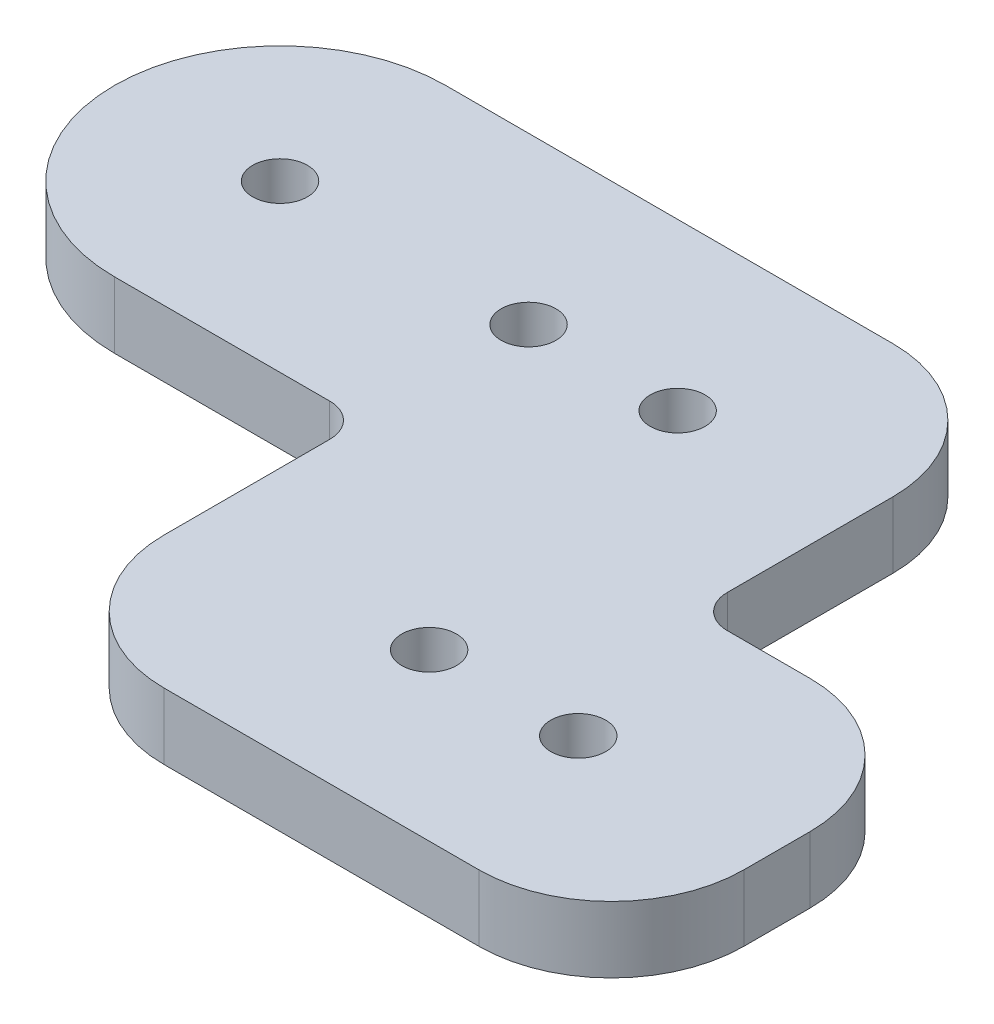
ISO-10303-21;
HEADER;
FILE_DESCRIPTION(('STEP AP214'),'2;1');
FILE_NAME('part.step','',(''),(''),'','','');
FILE_SCHEMA(('AUTOMOTIVE_DESIGN { 1 0 10303 214 1 1 1 1 }'));
ENDSEC;
DATA;
#1=APPLICATION_CONTEXT('core data for automotive mechanical design processes');
#2=APPLICATION_PROTOCOL_DEFINITION('international standard','automotive_design',2000,#1);
#3=PRODUCT_CONTEXT('',#1,'mechanical');
#4=PRODUCT('Part','Part','',(#3));
#5=PRODUCT_RELATED_PRODUCT_CATEGORY('part','',(#4));
#6=PRODUCT_DEFINITION_FORMATION('','',#4);
#7=PRODUCT_DEFINITION_CONTEXT('part definition',#1,'design');
#8=PRODUCT_DEFINITION('design','',#6,#7);
#9=PRODUCT_DEFINITION_SHAPE('','',#8);
#10=(LENGTH_UNIT() NAMED_UNIT(*) SI_UNIT(.MILLI.,.METRE.));
#11=(NAMED_UNIT(*) PLANE_ANGLE_UNIT() SI_UNIT($,.RADIAN.));
#12=(NAMED_UNIT(*) SI_UNIT($,.STERADIAN.) SOLID_ANGLE_UNIT());
#13=UNCERTAINTY_MEASURE_WITH_UNIT(LENGTH_MEASURE(1.E-05),#10,'distance_accuracy_value','');
#14=(GEOMETRIC_REPRESENTATION_CONTEXT(3) GLOBAL_UNCERTAINTY_ASSIGNED_CONTEXT((#13)) GLOBAL_UNIT_ASSIGNED_CONTEXT((#10,
#11,#12)) REPRESENTATION_CONTEXT('',''));
#15=CARTESIAN_POINT('',(0.,0.,0.));
#16=DIRECTION('',(0.,0.,1.));
#17=DIRECTION('',(1.,0.,0.));
#18=AXIS2_PLACEMENT_3D('',#15,#16,#17);
#19=CARTESIAN_POINT('',(0.,5.08,-12.7));
#20=DIRECTION('',(0.,0.,-1.));
#21=DIRECTION('',(-1.,0.,0.));
#22=AXIS2_PLACEMENT_3D('',#19,#20,#21);
#23=PLANE('',#22);
#24=DIRECTION('',(1.,0.,0.));
#25=VECTOR('',#24,1.);
#26=CARTESIAN_POINT('',(0.,5.08,-12.7));
#27=LINE('',#26,#25);
#28=CARTESIAN_POINT('',(0.,5.08,-12.7));
#29=VERTEX_POINT('',#28);
#30=CARTESIAN_POINT('',(34.29,5.08,-12.7));
#31=VERTEX_POINT('',#30);
#32=EDGE_CURVE('E143',#29,#31,#27,.T.);
#33=ORIENTED_EDGE('',*,*,#32,.T.);
#34=DIRECTION('',(0.,-1.,0.));
#35=VECTOR('',#34,1.);
#36=CARTESIAN_POINT('',(34.29,0.,-12.7));
#37=LINE('',#36,#35);
#38=CARTESIAN_POINT('',(34.29,0.,-12.7));
#39=VERTEX_POINT('',#38);
#40=EDGE_CURVE('E259',#31,#39,#37,.T.);
#41=ORIENTED_EDGE('',*,*,#40,.T.);
#42=DIRECTION('',(1.,0.,0.));
#43=VECTOR('',#42,1.);
#44=CARTESIAN_POINT('',(0.,0.,-12.7));
#45=LINE('',#44,#43);
#46=CARTESIAN_POINT('',(0.,0.,-12.7));
#47=VERTEX_POINT('',#46);
#48=EDGE_CURVE('E146',#47,#39,#45,.T.);
#49=ORIENTED_EDGE('',*,*,#48,.F.);
#50=DIRECTION('',(0.,-1.,0.));
#51=VECTOR('',#50,1.);
#52=CARTESIAN_POINT('',(0.,5.08,-12.7));
#53=LINE('',#52,#51);
#54=EDGE_CURVE('E139',#29,#47,#53,.T.);
#55=ORIENTED_EDGE('',*,*,#54,.F.);
#56=EDGE_LOOP('',(#33,#41,#49,#55));
#57=FACE_BOUND('',#56,.T.);
#58=ADVANCED_FACE('F35',(#57),#23,.T.);
#59=CARTESIAN_POINT('',(0.,5.08,0.));
#60=DIRECTION('',(0.,-1.,0.));
#61=DIRECTION('',(0.,0.,-1.));
#62=AXIS2_PLACEMENT_3D('',#59,#60,#61);
#63=CYLINDRICAL_SURFACE('',#62,12.7);
#64=CARTESIAN_POINT('',(0.,0.,0.));
#65=DIRECTION('',(0.,1.,0.));
#66=DIRECTION('',(0.,0.,1.));
#67=AXIS2_PLACEMENT_3D('',#64,#65,#66);
#68=CIRCLE('',#67,12.7);
#69=CARTESIAN_POINT('',(0.,0.,12.7));
#70=VERTEX_POINT('',#69);
#71=EDGE_CURVE('E200',#47,#70,#68,.T.);
#72=ORIENTED_EDGE('',*,*,#71,.T.);
#73=DIRECTION('',(0.,-1.,0.));
#74=VECTOR('',#73,1.);
#75=CARTESIAN_POINT('',(0.,5.08,12.7));
#76=LINE('',#75,#74);
#77=CARTESIAN_POINT('',(0.,5.08,12.7));
#78=VERTEX_POINT('',#77);
#79=EDGE_CURVE('E151',#78,#70,#76,.T.);
#80=ORIENTED_EDGE('',*,*,#79,.F.);
#81=CARTESIAN_POINT('',(0.,5.08,0.));
#82=DIRECTION('',(0.,1.,0.));
#83=DIRECTION('',(0.,0.,1.));
#84=AXIS2_PLACEMENT_3D('',#81,#82,#83);
#85=CIRCLE('',#84,12.7);
#86=EDGE_CURVE('E155',#29,#78,#85,.T.);
#87=ORIENTED_EDGE('',*,*,#86,.F.);
#88=ORIENTED_EDGE('',*,*,#54,.T.);
#89=EDGE_LOOP('',(#72,#80,#87,#88));
#90=FACE_BOUND('',#89,.T.);
#91=ADVANCED_FACE('F156',(#90),#63,.T.);
#92=CARTESIAN_POINT('',(0.,5.08,12.7));
#93=DIRECTION('',(0.,0.,-1.));
#94=DIRECTION('',(-1.,0.,0.));
#95=AXIS2_PLACEMENT_3D('',#92,#93,#94);
#96=PLANE('',#95);
#97=DIRECTION('',(1.,0.,0.));
#98=VECTOR('',#97,1.);
#99=CARTESIAN_POINT('',(0.,0.,12.7));
#100=LINE('',#99,#98);
#101=CARTESIAN_POINT('',(16.51,0.,12.7));
#102=VERTEX_POINT('',#101);
#103=EDGE_CURVE('E202',#70,#102,#100,.T.);
#104=ORIENTED_EDGE('',*,*,#103,.T.);
#105=DIRECTION('',(0.,-1.,0.));
#106=VECTOR('',#105,1.);
#107=CARTESIAN_POINT('',(16.51,5.08,12.7));
#108=LINE('',#107,#106);
#109=CARTESIAN_POINT('',(16.51,5.08,12.7));
#110=VERTEX_POINT('',#109);
#111=EDGE_CURVE('E227',#102,#110,#108,.F.);
#112=ORIENTED_EDGE('',*,*,#111,.T.);
#113=DIRECTION('',(1.,0.,0.));
#114=VECTOR('',#113,1.);
#115=CARTESIAN_POINT('',(0.,5.08,12.7));
#116=LINE('',#115,#114);
#117=EDGE_CURVE('E159',#78,#110,#116,.T.);
#118=ORIENTED_EDGE('',*,*,#117,.F.);
#119=ORIENTED_EDGE('',*,*,#79,.T.);
#120=EDGE_LOOP('',(#104,#112,#118,#119));
#121=FACE_BOUND('',#120,.T.);
#122=ADVANCED_FACE('F306',(#121),#96,.F.);
#123=CARTESIAN_POINT('',(19.05,5.08,0.));
#124=DIRECTION('',(-1.,0.,0.));
#125=DIRECTION('',(0.,0.,1.));
#126=AXIS2_PLACEMENT_3D('',#123,#124,#125);
#127=PLANE('',#126);
#128=DIRECTION('',(0.,0.,-1.));
#129=VECTOR('',#128,1.);
#130=CARTESIAN_POINT('',(19.05,0.,0.));
#131=LINE('',#130,#129);
#132=CARTESIAN_POINT('',(19.05,0.,27.94));
#133=VERTEX_POINT('',#132);
#134=CARTESIAN_POINT('',(19.05,0.,15.24));
#135=VERTEX_POINT('',#134);
#136=EDGE_CURVE('E205',#133,#135,#131,.T.);
#137=ORIENTED_EDGE('',*,*,#136,.F.);
#138=DIRECTION('',(0.,-1.,0.));
#139=VECTOR('',#138,1.);
#140=CARTESIAN_POINT('',(19.05,5.08,27.94));
#141=LINE('',#140,#139);
#142=CARTESIAN_POINT('',(19.05,5.08,27.94));
#143=VERTEX_POINT('',#142);
#144=EDGE_CURVE('E251',#133,#143,#141,.F.);
#145=ORIENTED_EDGE('',*,*,#144,.T.);
#146=DIRECTION('',(0.,0.,-1.));
#147=VECTOR('',#146,1.);
#148=CARTESIAN_POINT('',(19.05,5.08,0.));
#149=LINE('',#148,#147);
#150=CARTESIAN_POINT('',(19.05,5.08,15.24));
#151=VERTEX_POINT('',#150);
#152=EDGE_CURVE('E173',#143,#151,#149,.T.);
#153=ORIENTED_EDGE('',*,*,#152,.T.);
#154=DIRECTION('',(0.,-1.,0.));
#155=VECTOR('',#154,1.);
#156=CARTESIAN_POINT('',(19.05,5.08,15.24));
#157=LINE('',#156,#155);
#158=EDGE_CURVE('E224',#151,#135,#157,.T.);
#159=ORIENTED_EDGE('',*,*,#158,.T.);
#160=EDGE_LOOP('',(#137,#145,#153,#159));
#161=FACE_BOUND('',#160,.T.);
#162=ADVANCED_FACE('F344',(#161),#127,.T.);
#163=CARTESIAN_POINT('',(0.,5.08,38.1));
#164=DIRECTION('',(0.,0.,-1.));
#165=DIRECTION('',(-1.,0.,0.));
#166=AXIS2_PLACEMENT_3D('',#163,#164,#165);
#167=PLANE('',#166);
#168=DIRECTION('',(1.,0.,0.));
#169=VECTOR('',#168,1.);
#170=CARTESIAN_POINT('',(0.,5.08,38.1));
#171=LINE('',#170,#169);
#172=CARTESIAN_POINT('',(29.21,5.08,38.1));
#173=VERTEX_POINT('',#172);
#174=CARTESIAN_POINT('',(53.34,5.08,38.1));
#175=VERTEX_POINT('',#174);
#176=EDGE_CURVE('E175',#173,#175,#171,.T.);
#177=ORIENTED_EDGE('',*,*,#176,.F.);
#178=DIRECTION('',(0.,-1.,0.));
#179=VECTOR('',#178,1.);
#180=CARTESIAN_POINT('',(29.21,0.,38.1));
#181=LINE('',#180,#179);
#182=CARTESIAN_POINT('',(29.21,0.,38.1));
#183=VERTEX_POINT('',#182);
#184=EDGE_CURVE('E240',#173,#183,#181,.T.);
#185=ORIENTED_EDGE('',*,*,#184,.T.);
#186=DIRECTION('',(1.,0.,0.));
#187=VECTOR('',#186,1.);
#188=CARTESIAN_POINT('',(0.,0.,38.1));
#189=LINE('',#188,#187);
#190=CARTESIAN_POINT('',(53.34,0.,38.1));
#191=VERTEX_POINT('',#190);
#192=EDGE_CURVE('E207',#183,#191,#189,.T.);
#193=ORIENTED_EDGE('',*,*,#192,.T.);
#194=DIRECTION('',(0.,-1.,0.));
#195=VECTOR('',#194,1.);
#196=CARTESIAN_POINT('',(53.34,5.08,38.1));
#197=LINE('',#196,#195);
#198=EDGE_CURVE('E238',#191,#175,#197,.F.);
#199=ORIENTED_EDGE('',*,*,#198,.T.);
#200=EDGE_LOOP('',(#177,#185,#193,#199));
#201=FACE_BOUND('',#200,.T.);
#202=ADVANCED_FACE('F349',(#201),#167,.F.);
#203=CARTESIAN_POINT('',(63.5,5.08,0.));
#204=DIRECTION('',(-1.,0.,0.));
#205=DIRECTION('',(0.,0.,1.));
#206=AXIS2_PLACEMENT_3D('',#203,#204,#205);
#207=PLANE('',#206);
#208=DIRECTION('',(0.,0.,-1.));
#209=VECTOR('',#208,1.);
#210=CARTESIAN_POINT('',(63.5,0.,0.));
#211=LINE('',#210,#209);
#212=CARTESIAN_POINT('',(63.5,0.,27.94));
#213=VERTEX_POINT('',#212);
#214=CARTESIAN_POINT('',(63.5,0.,22.86));
#215=VERTEX_POINT('',#214);
#216=EDGE_CURVE('E210',#213,#215,#211,.T.);
#217=ORIENTED_EDGE('',*,*,#216,.T.);
#218=DIRECTION('',(0.,-1.,0.));
#219=VECTOR('',#218,1.);
#220=CARTESIAN_POINT('',(63.5,5.08,22.86));
#221=LINE('',#220,#219);
#222=CARTESIAN_POINT('',(63.5,5.08,22.86));
#223=VERTEX_POINT('',#222);
#224=EDGE_CURVE('E11',#215,#223,#221,.F.);
#225=ORIENTED_EDGE('',*,*,#224,.T.);
#226=DIRECTION('',(0.,0.,-1.));
#227=VECTOR('',#226,1.);
#228=CARTESIAN_POINT('',(63.5,5.08,0.));
#229=LINE('',#228,#227);
#230=CARTESIAN_POINT('',(63.5,5.08,27.94));
#231=VERTEX_POINT('',#230);
#232=EDGE_CURVE('E178',#231,#223,#229,.T.);
#233=ORIENTED_EDGE('',*,*,#232,.F.);
#234=DIRECTION('',(0.,-1.,0.));
#235=VECTOR('',#234,1.);
#236=CARTESIAN_POINT('',(63.5,5.08,27.94));
#237=LINE('',#236,#235);
#238=EDGE_CURVE('E43',#231,#213,#237,.T.);
#239=ORIENTED_EDGE('',*,*,#238,.T.);
#240=EDGE_LOOP('',(#217,#225,#233,#239));
#241=FACE_BOUND('',#240,.T.);
#242=ADVANCED_FACE('F269',(#241),#207,.F.);
#243=CARTESIAN_POINT('',(0.,5.08,12.7));
#244=DIRECTION('',(0.,0.,-1.));
#245=DIRECTION('',(-1.,0.,0.));
#246=AXIS2_PLACEMENT_3D('',#243,#244,#245);
#247=PLANE('',#246);
#248=DIRECTION('',(1.,0.,0.));
#249=VECTOR('',#248,1.);
#250=CARTESIAN_POINT('',(0.,5.08,12.7));
#251=LINE('',#250,#249);
#252=CARTESIAN_POINT('',(46.99,5.08,12.7));
#253=VERTEX_POINT('',#252);
#254=CARTESIAN_POINT('',(53.34,5.08,12.7));
#255=VERTEX_POINT('',#254);
#256=EDGE_CURVE('E180',#253,#255,#251,.T.);
#257=ORIENTED_EDGE('',*,*,#256,.T.);
#258=DIRECTION('',(0.,-1.,0.));
#259=VECTOR('',#258,1.);
#260=CARTESIAN_POINT('',(53.34,0.,12.7));
#261=LINE('',#260,#259);
#262=CARTESIAN_POINT('',(53.34,0.,12.7));
#263=VERTEX_POINT('',#262);
#264=EDGE_CURVE('E262',#255,#263,#261,.T.);
#265=ORIENTED_EDGE('',*,*,#264,.T.);
#266=DIRECTION('',(1.,0.,0.));
#267=VECTOR('',#266,1.);
#268=CARTESIAN_POINT('',(0.,0.,12.7));
#269=LINE('',#268,#267);
#270=CARTESIAN_POINT('',(46.99,0.,12.7));
#271=VERTEX_POINT('',#270);
#272=EDGE_CURVE('E213',#271,#263,#269,.T.);
#273=ORIENTED_EDGE('',*,*,#272,.F.);
#274=DIRECTION('',(0.,-1.,0.));
#275=VECTOR('',#274,1.);
#276=CARTESIAN_POINT('',(46.99,5.08,12.7));
#277=LINE('',#276,#275);
#278=EDGE_CURVE('E222',#271,#253,#277,.F.);
#279=ORIENTED_EDGE('',*,*,#278,.T.);
#280=EDGE_LOOP('',(#257,#265,#273,#279));
#281=FACE_BOUND('',#280,.T.);
#282=ADVANCED_FACE('F281',(#281),#247,.T.);
#283=CARTESIAN_POINT('',(0.,5.08,0.));
#284=DIRECTION('',(0.,-1.,0.));
#285=DIRECTION('',(0.,0.,-1.));
#286=AXIS2_PLACEMENT_3D('',#283,#284,#285);
#287=CYLINDRICAL_SURFACE('',#286,2.1);
#288=CARTESIAN_POINT('',(0.,5.08,0.));
#289=DIRECTION('',(0.,1.,0.));
#290=DIRECTION('',(0.,0.,1.));
#291=AXIS2_PLACEMENT_3D('',#288,#289,#290);
#292=CIRCLE('',#291,2.1);
#293=CARTESIAN_POINT('',(0.,5.08,2.1));
#294=VERTEX_POINT('',#293);
#295=EDGE_CURVE('E165',#294,#294,#292,.T.);
#296=ORIENTED_EDGE('',*,*,#295,.T.);
#297=EDGE_LOOP('',(#296));
#298=FACE_BOUND('',#297,.T.);
#299=CARTESIAN_POINT('',(0.,0.,0.));
#300=DIRECTION('',(0.,1.,0.));
#301=DIRECTION('',(0.,0.,1.));
#302=AXIS2_PLACEMENT_3D('',#299,#300,#301);
#303=CIRCLE('',#302,2.1);
#304=CARTESIAN_POINT('',(0.,0.,2.1));
#305=VERTEX_POINT('',#304);
#306=EDGE_CURVE('E196',#305,#305,#303,.T.);
#307=ORIENTED_EDGE('',*,*,#306,.F.);
#308=EDGE_LOOP('',(#307));
#309=FACE_BOUND('',#308,.T.);
#310=ADVANCED_FACE('F310',(#298,#309),#287,.F.);
#311=CARTESIAN_POINT('',(19.05,5.08,0.));
#312=DIRECTION('',(0.,-1.,0.));
#313=DIRECTION('',(0.,0.,-1.));
#314=AXIS2_PLACEMENT_3D('',#311,#312,#313);
#315=CYLINDRICAL_SURFACE('',#314,2.09999999999999);
#316=CARTESIAN_POINT('',(19.05,5.08,0.));
#317=DIRECTION('',(0.,1.,0.));
#318=DIRECTION('',(0.,0.,1.));
#319=AXIS2_PLACEMENT_3D('',#316,#317,#318);
#320=CIRCLE('',#319,2.09999999999999);
#321=CARTESIAN_POINT('',(19.05,5.08,2.09999999999999));
#322=VERTEX_POINT('',#321);
#323=EDGE_CURVE('E168',#322,#322,#320,.T.);
#324=ORIENTED_EDGE('',*,*,#323,.T.);
#325=EDGE_LOOP('',(#324));
#326=FACE_BOUND('',#325,.T.);
#327=CARTESIAN_POINT('',(19.05,0.,0.));
#328=DIRECTION('',(0.,1.,0.));
#329=DIRECTION('',(0.,0.,1.));
#330=AXIS2_PLACEMENT_3D('',#327,#328,#329);
#331=CIRCLE('',#330,2.09999999999999);
#332=CARTESIAN_POINT('',(19.05,0.,2.09999999999999));
#333=VERTEX_POINT('',#332);
#334=EDGE_CURVE('E193',#333,#333,#331,.T.);
#335=ORIENTED_EDGE('',*,*,#334,.F.);
#336=EDGE_LOOP('',(#335));
#337=FACE_BOUND('',#336,.T.);
#338=ADVANCED_FACE('F313',(#326,#337),#315,.F.);
#339=CARTESIAN_POINT('',(30.48,5.08,0.));
#340=DIRECTION('',(0.,-1.,0.));
#341=DIRECTION('',(0.,0.,-1.));
#342=AXIS2_PLACEMENT_3D('',#339,#340,#341);
#343=CYLINDRICAL_SURFACE('',#342,2.1);
#344=CARTESIAN_POINT('',(30.48,5.08,0.));
#345=DIRECTION('',(0.,1.,0.));
#346=DIRECTION('',(0.,0.,1.));
#347=AXIS2_PLACEMENT_3D('',#344,#345,#346);
#348=CIRCLE('',#347,2.1);
#349=CARTESIAN_POINT('',(30.48,5.08,2.1));
#350=VERTEX_POINT('',#349);
#351=EDGE_CURVE('E509',#350,#350,#348,.T.);
#352=ORIENTED_EDGE('',*,*,#351,.T.);
#353=EDGE_LOOP('',(#352));
#354=FACE_BOUND('',#353,.T.);
#355=CARTESIAN_POINT('',(30.48,0.,0.));
#356=DIRECTION('',(0.,1.,0.));
#357=DIRECTION('',(0.,0.,1.));
#358=AXIS2_PLACEMENT_3D('',#355,#356,#357);
#359=CIRCLE('',#358,2.1);
#360=CARTESIAN_POINT('',(30.48,0.,2.1));
#361=VERTEX_POINT('',#360);
#362=EDGE_CURVE('E190',#361,#361,#359,.T.);
#363=ORIENTED_EDGE('',*,*,#362,.F.);
#364=EDGE_LOOP('',(#363));
#365=FACE_BOUND('',#364,.T.);
#366=ADVANCED_FACE('F317',(#354,#365),#343,.F.);
#367=CARTESIAN_POINT('',(36.83,5.08,25.4));
#368=DIRECTION('',(0.,-1.,0.));
#369=DIRECTION('',(0.,0.,-1.));
#370=AXIS2_PLACEMENT_3D('',#367,#368,#369);
#371=CYLINDRICAL_SURFACE('',#370,2.1);
#372=CARTESIAN_POINT('',(36.83,5.08,25.4));
#373=DIRECTION('',(0.,1.,0.));
#374=DIRECTION('',(0.,0.,1.));
#375=AXIS2_PLACEMENT_3D('',#372,#373,#374);
#376=CIRCLE('',#375,2.1);
#377=CARTESIAN_POINT('',(36.83,5.08,27.5));
#378=VERTEX_POINT('',#377);
#379=EDGE_CURVE('E505',#378,#378,#376,.T.);
#380=ORIENTED_EDGE('',*,*,#379,.T.);
#381=EDGE_LOOP('',(#380));
#382=FACE_BOUND('',#381,.T.);
#383=CARTESIAN_POINT('',(36.83,0.,25.4));
#384=DIRECTION('',(0.,1.,0.));
#385=DIRECTION('',(0.,0.,1.));
#386=AXIS2_PLACEMENT_3D('',#383,#384,#385);
#387=CIRCLE('',#386,2.1);
#388=CARTESIAN_POINT('',(36.83,0.,27.5));
#389=VERTEX_POINT('',#388);
#390=EDGE_CURVE('E187',#389,#389,#387,.T.);
#391=ORIENTED_EDGE('',*,*,#390,.F.);
#392=EDGE_LOOP('',(#391));
#393=FACE_BOUND('',#392,.T.);
#394=ADVANCED_FACE('F321',(#382,#393),#371,.F.);
#395=CARTESIAN_POINT('',(48.26,5.08,25.4));
#396=DIRECTION('',(0.,-1.,0.));
#397=DIRECTION('',(0.,0.,-1.));
#398=AXIS2_PLACEMENT_3D('',#395,#396,#397);
#399=CYLINDRICAL_SURFACE('',#398,2.1);
#400=CARTESIAN_POINT('',(48.26,5.08,25.4));
#401=DIRECTION('',(0.,1.,0.));
#402=DIRECTION('',(0.,0.,1.));
#403=AXIS2_PLACEMENT_3D('',#400,#401,#402);
#404=CIRCLE('',#403,2.1);
#405=CARTESIAN_POINT('',(48.26,5.08,27.5));
#406=VERTEX_POINT('',#405);
#407=EDGE_CURVE('E218',#406,#406,#404,.T.);
#408=ORIENTED_EDGE('',*,*,#407,.T.);
#409=EDGE_LOOP('',(#408));
#410=FACE_BOUND('',#409,.T.);
#411=CARTESIAN_POINT('',(48.26,0.,25.4));
#412=DIRECTION('',(0.,1.,0.));
#413=DIRECTION('',(0.,0.,1.));
#414=AXIS2_PLACEMENT_3D('',#411,#412,#413);
#415=CIRCLE('',#414,2.1);
#416=CARTESIAN_POINT('',(48.26,0.,27.5));
#417=VERTEX_POINT('',#416);
#418=EDGE_CURVE('E184',#417,#417,#415,.T.);
#419=ORIENTED_EDGE('',*,*,#418,.F.);
#420=EDGE_LOOP('',(#419));
#421=FACE_BOUND('',#420,.T.);
#422=ADVANCED_FACE('F325',(#410,#421),#399,.F.);
#423=CARTESIAN_POINT('',(44.45,5.08,0.));
#424=DIRECTION('',(-1.,0.,0.));
#425=DIRECTION('',(0.,0.,1.));
#426=AXIS2_PLACEMENT_3D('',#423,#424,#425);
#427=PLANE('',#426);
#428=DIRECTION('',(0.,0.,-1.));
#429=VECTOR('',#428,1.);
#430=CARTESIAN_POINT('',(44.45,0.,0.));
#431=LINE('',#430,#429);
#432=CARTESIAN_POINT('',(44.45,0.,10.16));
#433=VERTEX_POINT('',#432);
#434=CARTESIAN_POINT('',(44.45,0.,-2.54));
#435=VERTEX_POINT('',#434);
#436=EDGE_CURVE('E216',#433,#435,#431,.T.);
#437=ORIENTED_EDGE('',*,*,#436,.T.);
#438=DIRECTION('',(0.,-1.,0.));
#439=VECTOR('',#438,1.);
#440=CARTESIAN_POINT('',(44.45,5.08,-2.54));
#441=LINE('',#440,#439);
#442=CARTESIAN_POINT('',(44.45,5.08,-2.54));
#443=VERTEX_POINT('',#442);
#444=EDGE_CURVE('E50',#435,#443,#441,.F.);
#445=ORIENTED_EDGE('',*,*,#444,.T.);
#446=DIRECTION('',(0.,0.,-1.));
#447=VECTOR('',#446,1.);
#448=CARTESIAN_POINT('',(44.45,5.08,0.));
#449=LINE('',#448,#447);
#450=CARTESIAN_POINT('',(44.45,5.08,10.16));
#451=VERTEX_POINT('',#450);
#452=EDGE_CURVE('E182',#451,#443,#449,.T.);
#453=ORIENTED_EDGE('',*,*,#452,.F.);
#454=DIRECTION('',(0.,-1.,0.));
#455=VECTOR('',#454,1.);
#456=CARTESIAN_POINT('',(44.45,5.08,10.16));
#457=LINE('',#456,#455);
#458=EDGE_CURVE('E150',#451,#433,#457,.T.);
#459=ORIENTED_EDGE('',*,*,#458,.T.);
#460=EDGE_LOOP('',(#437,#445,#453,#459));
#461=FACE_BOUND('',#460,.T.);
#462=ADVANCED_FACE('F288',(#461),#427,.F.);
#463=CARTESIAN_POINT('',(0.,5.08,0.));
#464=DIRECTION('',(0.,1.,0.));
#465=DIRECTION('',(0.,0.,1.));
#466=AXIS2_PLACEMENT_3D('',#463,#464,#465);
#467=PLANE('',#466);
#468=ORIENTED_EDGE('',*,*,#407,.F.);
#469=EDGE_LOOP('',(#468));
#470=FACE_BOUND('',#469,.T.);
#471=ORIENTED_EDGE('',*,*,#379,.F.);
#472=EDGE_LOOP('',(#471));
#473=FACE_BOUND('',#472,.T.);
#474=ORIENTED_EDGE('',*,*,#351,.F.);
#475=EDGE_LOOP('',(#474));
#476=FACE_BOUND('',#475,.T.);
#477=ORIENTED_EDGE('',*,*,#323,.F.);
#478=EDGE_LOOP('',(#477));
#479=FACE_BOUND('',#478,.T.);
#480=ORIENTED_EDGE('',*,*,#295,.F.);
#481=EDGE_LOOP('',(#480));
#482=FACE_BOUND('',#481,.T.);
#483=ORIENTED_EDGE('',*,*,#152,.F.);
#484=CARTESIAN_POINT('',(29.21,5.08,27.94));
#485=DIRECTION('',(0.,1.,0.));
#486=DIRECTION('',(0.,0.,1.));
#487=AXIS2_PLACEMENT_3D('',#484,#485,#486);
#488=CIRCLE('',#487,10.16);
#489=EDGE_CURVE('E257',#143,#173,#488,.T.);
#490=ORIENTED_EDGE('',*,*,#489,.T.);
#491=ORIENTED_EDGE('',*,*,#176,.T.);
#492=CARTESIAN_POINT('',(53.34,5.08,27.94));
#493=DIRECTION('',(0.,1.,0.));
#494=DIRECTION('',(0.,0.,1.));
#495=AXIS2_PLACEMENT_3D('',#492,#493,#494);
#496=CIRCLE('',#495,10.16);
#497=EDGE_CURVE('E253',#175,#231,#496,.T.);
#498=ORIENTED_EDGE('',*,*,#497,.T.);
#499=ORIENTED_EDGE('',*,*,#232,.T.);
#500=CARTESIAN_POINT('',(53.34,5.08,22.86));
#501=DIRECTION('',(0.,1.,0.));
#502=DIRECTION('',(0.,0.,1.));
#503=AXIS2_PLACEMENT_3D('',#500,#501,#502);
#504=CIRCLE('',#503,10.16);
#505=EDGE_CURVE('E58',#223,#255,#504,.T.);
#506=ORIENTED_EDGE('',*,*,#505,.T.);
#507=ORIENTED_EDGE('',*,*,#256,.F.);
#508=CARTESIAN_POINT('',(46.99,5.08,10.16));
#509=DIRECTION('',(0.,1.,0.));
#510=DIRECTION('',(0.,0.,1.));
#511=AXIS2_PLACEMENT_3D('',#508,#509,#510);
#512=CIRCLE('',#511,2.54);
#513=EDGE_CURVE('E231',#253,#451,#512,.F.);
#514=ORIENTED_EDGE('',*,*,#513,.T.);
#515=ORIENTED_EDGE('',*,*,#452,.T.);
#516=CARTESIAN_POINT('',(34.29,5.08,-2.54));
#517=DIRECTION('',(0.,1.,0.));
#518=DIRECTION('',(0.,0.,1.));
#519=AXIS2_PLACEMENT_3D('',#516,#517,#518);
#520=CIRCLE('',#519,10.16);
#521=EDGE_CURVE('E164',#443,#31,#520,.T.);
#522=ORIENTED_EDGE('',*,*,#521,.T.);
#523=ORIENTED_EDGE('',*,*,#32,.F.);
#524=ORIENTED_EDGE('',*,*,#86,.T.);
#525=ORIENTED_EDGE('',*,*,#117,.T.);
#526=CARTESIAN_POINT('',(16.51,5.08,15.24));
#527=DIRECTION('',(0.,1.,0.));
#528=DIRECTION('',(0.,0.,1.));
#529=AXIS2_PLACEMENT_3D('',#526,#527,#528);
#530=CIRCLE('',#529,2.54);
#531=EDGE_CURVE('E235',#110,#151,#530,.F.);
#532=ORIENTED_EDGE('',*,*,#531,.T.);
#533=EDGE_LOOP('',(#483,#490,#491,#498,#499,#506,#507,#514,#515,#522,#523,#524,#525,#532));
#534=FACE_BOUND('',#533,.T.);
#535=ADVANCED_FACE('F162',(#470,#473,#476,#479,#482,#534),#467,.T.);
#536=CARTESIAN_POINT('',(0.,0.,0.));
#537=DIRECTION('',(0.,1.,0.));
#538=DIRECTION('',(0.,0.,1.));
#539=AXIS2_PLACEMENT_3D('',#536,#537,#538);
#540=PLANE('',#539);
#541=ORIENTED_EDGE('',*,*,#418,.T.);
#542=EDGE_LOOP('',(#541));
#543=FACE_BOUND('',#542,.T.);
#544=ORIENTED_EDGE('',*,*,#390,.T.);
#545=EDGE_LOOP('',(#544));
#546=FACE_BOUND('',#545,.T.);
#547=ORIENTED_EDGE('',*,*,#362,.T.);
#548=EDGE_LOOP('',(#547));
#549=FACE_BOUND('',#548,.T.);
#550=ORIENTED_EDGE('',*,*,#334,.T.);
#551=EDGE_LOOP('',(#550));
#552=FACE_BOUND('',#551,.T.);
#553=ORIENTED_EDGE('',*,*,#306,.T.);
#554=EDGE_LOOP('',(#553));
#555=FACE_BOUND('',#554,.T.);
#556=ORIENTED_EDGE('',*,*,#192,.F.);
#557=CARTESIAN_POINT('',(29.21,0.,27.94));
#558=DIRECTION('',(0.,1.,0.));
#559=DIRECTION('',(0.,0.,1.));
#560=AXIS2_PLACEMENT_3D('',#557,#558,#559);
#561=CIRCLE('',#560,10.16);
#562=EDGE_CURVE('E249',#183,#133,#561,.F.);
#563=ORIENTED_EDGE('',*,*,#562,.T.);
#564=ORIENTED_EDGE('',*,*,#136,.T.);
#565=CARTESIAN_POINT('',(16.51,0.,15.24));
#566=DIRECTION('',(0.,1.,0.));
#567=DIRECTION('',(0.,0.,1.));
#568=AXIS2_PLACEMENT_3D('',#565,#566,#567);
#569=CIRCLE('',#568,2.54);
#570=EDGE_CURVE('E233',#135,#102,#569,.T.);
#571=ORIENTED_EDGE('',*,*,#570,.T.);
#572=ORIENTED_EDGE('',*,*,#103,.F.);
#573=ORIENTED_EDGE('',*,*,#71,.F.);
#574=ORIENTED_EDGE('',*,*,#48,.T.);
#575=CARTESIAN_POINT('',(34.29,0.,-2.54));
#576=DIRECTION('',(0.,1.,0.));
#577=DIRECTION('',(0.,0.,1.));
#578=AXIS2_PLACEMENT_3D('',#575,#576,#577);
#579=CIRCLE('',#578,10.16);
#580=EDGE_CURVE('E247',#39,#435,#579,.F.);
#581=ORIENTED_EDGE('',*,*,#580,.T.);
#582=ORIENTED_EDGE('',*,*,#436,.F.);
#583=CARTESIAN_POINT('',(46.99,0.,10.16));
#584=DIRECTION('',(0.,1.,0.));
#585=DIRECTION('',(0.,0.,1.));
#586=AXIS2_PLACEMENT_3D('',#583,#584,#585);
#587=CIRCLE('',#586,2.54);
#588=EDGE_CURVE('E229',#433,#271,#587,.T.);
#589=ORIENTED_EDGE('',*,*,#588,.T.);
#590=ORIENTED_EDGE('',*,*,#272,.T.);
#591=CARTESIAN_POINT('',(53.34,0.,22.86));
#592=DIRECTION('',(0.,1.,0.));
#593=DIRECTION('',(0.,0.,1.));
#594=AXIS2_PLACEMENT_3D('',#591,#592,#593);
#595=CIRCLE('',#594,10.16);
#596=EDGE_CURVE('E245',#263,#215,#595,.F.);
#597=ORIENTED_EDGE('',*,*,#596,.T.);
#598=ORIENTED_EDGE('',*,*,#216,.F.);
#599=CARTESIAN_POINT('',(53.34,0.,27.94));
#600=DIRECTION('',(0.,1.,0.));
#601=DIRECTION('',(0.,0.,1.));
#602=AXIS2_PLACEMENT_3D('',#599,#600,#601);
#603=CIRCLE('',#602,10.16);
#604=EDGE_CURVE('E243',#213,#191,#603,.F.);
#605=ORIENTED_EDGE('',*,*,#604,.T.);
#606=EDGE_LOOP('',(#556,#563,#564,#571,#572,#573,#574,#581,#582,#589,#590,#597,#598,#605));
#607=FACE_BOUND('',#606,.T.);
#608=ADVANCED_FACE('F275',(#543,#546,#549,#552,#555,#607),#540,.F.);
#609=CARTESIAN_POINT('',(46.99,5.08,10.16));
#610=DIRECTION('',(0.,-1.,0.));
#611=DIRECTION('',(0.,0.,-1.));
#612=AXIS2_PLACEMENT_3D('',#609,#610,#611);
#613=CYLINDRICAL_SURFACE('',#612,2.54);
#614=ORIENTED_EDGE('',*,*,#513,.F.);
#615=ORIENTED_EDGE('',*,*,#278,.F.);
#616=ORIENTED_EDGE('',*,*,#588,.F.);
#617=ORIENTED_EDGE('',*,*,#458,.F.);
#618=EDGE_LOOP('',(#614,#615,#616,#617));
#619=FACE_BOUND('',#618,.T.);
#620=ADVANCED_FACE('F286',(#619),#613,.F.);
#621=CARTESIAN_POINT('',(16.51,5.08,15.24));
#622=DIRECTION('',(0.,-1.,0.));
#623=DIRECTION('',(0.,0.,-1.));
#624=AXIS2_PLACEMENT_3D('',#621,#622,#623);
#625=CYLINDRICAL_SURFACE('',#624,2.54);
#626=ORIENTED_EDGE('',*,*,#531,.F.);
#627=ORIENTED_EDGE('',*,*,#111,.F.);
#628=ORIENTED_EDGE('',*,*,#570,.F.);
#629=ORIENTED_EDGE('',*,*,#158,.F.);
#630=EDGE_LOOP('',(#626,#627,#628,#629));
#631=FACE_BOUND('',#630,.T.);
#632=ADVANCED_FACE('F298',(#631),#625,.F.);
#633=CARTESIAN_POINT('',(29.21,5.08,27.94));
#634=DIRECTION('',(0.,1.,0.));
#635=DIRECTION('',(0.,0.,1.));
#636=AXIS2_PLACEMENT_3D('',#633,#634,#635);
#637=CYLINDRICAL_SURFACE('',#636,10.16);
#638=ORIENTED_EDGE('',*,*,#489,.F.);
#639=ORIENTED_EDGE('',*,*,#144,.F.);
#640=ORIENTED_EDGE('',*,*,#562,.F.);
#641=ORIENTED_EDGE('',*,*,#184,.F.);
#642=EDGE_LOOP('',(#638,#639,#640,#641));
#643=FACE_BOUND('',#642,.T.);
#644=ADVANCED_FACE('F292',(#643),#637,.T.);
#645=CARTESIAN_POINT('',(34.29,5.08,-2.54));
#646=DIRECTION('',(0.,1.,0.));
#647=DIRECTION('',(0.,0.,1.));
#648=AXIS2_PLACEMENT_3D('',#645,#646,#647);
#649=CYLINDRICAL_SURFACE('',#648,10.16);
#650=ORIENTED_EDGE('',*,*,#521,.F.);
#651=ORIENTED_EDGE('',*,*,#444,.F.);
#652=ORIENTED_EDGE('',*,*,#580,.F.);
#653=ORIENTED_EDGE('',*,*,#40,.F.);
#654=EDGE_LOOP('',(#650,#651,#652,#653));
#655=FACE_BOUND('',#654,.T.);
#656=ADVANCED_FACE('F290',(#655),#649,.T.);
#657=CARTESIAN_POINT('',(53.34,5.08,22.86));
#658=DIRECTION('',(0.,1.,0.));
#659=DIRECTION('',(0.,0.,1.));
#660=AXIS2_PLACEMENT_3D('',#657,#658,#659);
#661=CYLINDRICAL_SURFACE('',#660,10.16);
#662=ORIENTED_EDGE('',*,*,#505,.F.);
#663=ORIENTED_EDGE('',*,*,#224,.F.);
#664=ORIENTED_EDGE('',*,*,#596,.F.);
#665=ORIENTED_EDGE('',*,*,#264,.F.);
#666=EDGE_LOOP('',(#662,#663,#664,#665));
#667=FACE_BOUND('',#666,.T.);
#668=ADVANCED_FACE('F279',(#667),#661,.T.);
#669=CARTESIAN_POINT('',(53.34,5.08,27.94));
#670=DIRECTION('',(0.,-1.,0.));
#671=DIRECTION('',(0.,0.,-1.));
#672=AXIS2_PLACEMENT_3D('',#669,#670,#671);
#673=CYLINDRICAL_SURFACE('',#672,10.16);
#674=ORIENTED_EDGE('',*,*,#497,.F.);
#675=ORIENTED_EDGE('',*,*,#198,.F.);
#676=ORIENTED_EDGE('',*,*,#604,.F.);
#677=ORIENTED_EDGE('',*,*,#238,.F.);
#678=EDGE_LOOP('',(#674,#675,#676,#677));
#679=FACE_BOUND('',#678,.T.);
#680=ADVANCED_FACE('F37',(#679),#673,.T.);
#681=CLOSED_SHELL('',(#58,#91,#122,#162,#202,#242,#282,#310,#338,#366,#394,#422,#462,#535,#608,
#620,#632,#644,#656,#668,#680));
#682=MANIFOLD_SOLID_BREP('B2',#681);
#683=ADVANCED_BREP_SHAPE_REPRESENTATION('',(#18,#682),#14);
#684=SHAPE_DEFINITION_REPRESENTATION(#9,#683);
ENDSEC;
END-ISO-10303-21;
